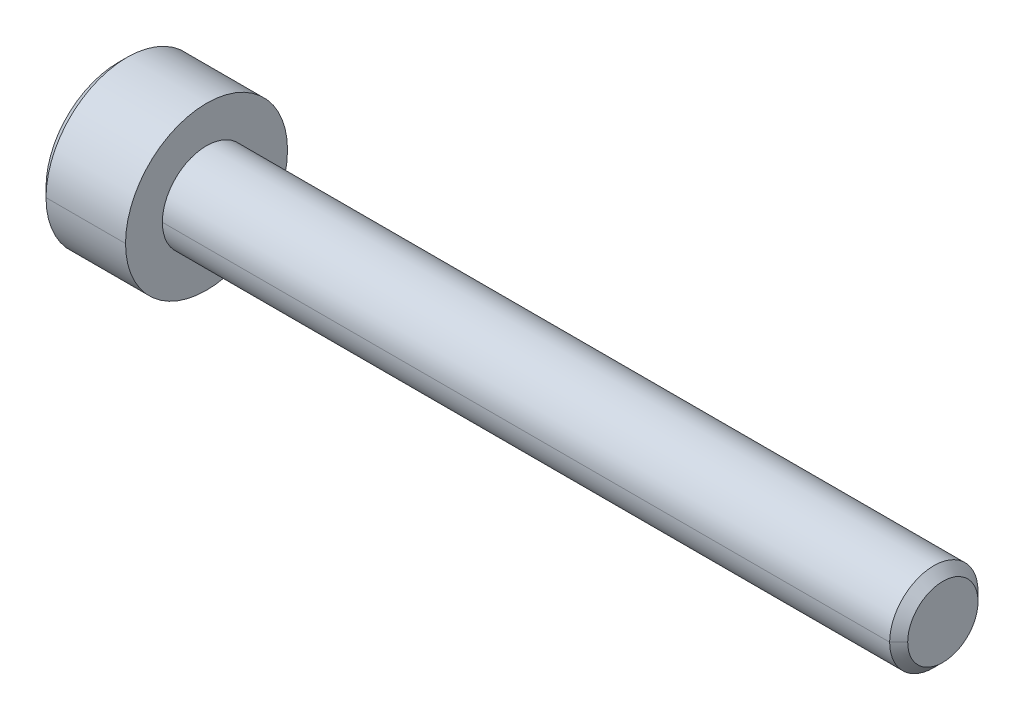
ISO-10303-21;
HEADER;
FILE_DESCRIPTION(('STEP AP214'),'2;1');
FILE_NAME('part.step','',(''),(''),'','','');
FILE_SCHEMA(('AUTOMOTIVE_DESIGN { 1 0 10303 214 1 1 1 1 }'));
ENDSEC;
DATA;
#1=APPLICATION_CONTEXT('core data for automotive mechanical design processes');
#2=APPLICATION_PROTOCOL_DEFINITION('international standard','automotive_design',2000,#1);
#3=PRODUCT_CONTEXT('',#1,'mechanical');
#4=PRODUCT('Part','Part','',(#3));
#5=PRODUCT_RELATED_PRODUCT_CATEGORY('part','',(#4));
#6=PRODUCT_DEFINITION_FORMATION('','',#4);
#7=PRODUCT_DEFINITION_CONTEXT('part definition',#1,'design');
#8=PRODUCT_DEFINITION('design','',#6,#7);
#9=PRODUCT_DEFINITION_SHAPE('','',#8);
#10=(LENGTH_UNIT() NAMED_UNIT(*) SI_UNIT(.MILLI.,.METRE.));
#11=(NAMED_UNIT(*) PLANE_ANGLE_UNIT() SI_UNIT($,.RADIAN.));
#12=(NAMED_UNIT(*) SI_UNIT($,.STERADIAN.) SOLID_ANGLE_UNIT());
#13=UNCERTAINTY_MEASURE_WITH_UNIT(LENGTH_MEASURE(1.E-05),#10,'distance_accuracy_value','');
#14=(GEOMETRIC_REPRESENTATION_CONTEXT(3) GLOBAL_UNCERTAINTY_ASSIGNED_CONTEXT((#13)) GLOBAL_UNIT_ASSIGNED_CONTEXT((#10,
#11,#12)) REPRESENTATION_CONTEXT('',''));
#15=CARTESIAN_POINT('',(0.,0.,0.));
#16=DIRECTION('',(0.,0.,1.));
#17=DIRECTION('',(1.,0.,0.));
#18=AXIS2_PLACEMENT_3D('',#15,#16,#17);
#19=CARTESIAN_POINT('',(-3.,0.,0.));
#20=DIRECTION('',(1.,0.,0.));
#21=DIRECTION('',(0.,-1.,0.));
#22=AXIS2_PLACEMENT_3D('',#19,#20,#21);
#23=CONICAL_SURFACE('',#22,2.45,0.7853981634);
#24=CARTESIAN_POINT('',(-2.7,0.,0.));
#25=DIRECTION('',(1.,0.,0.));
#26=DIRECTION('',(0.,0.,-1.));
#27=AXIS2_PLACEMENT_3D('',#24,#25,#26);
#28=CIRCLE('',#27,2.75);
#29=CARTESIAN_POINT('',(-2.7,0.,-2.75));
#30=VERTEX_POINT('',#29);
#31=CARTESIAN_POINT('',(-2.70000000000077,0.,2.75000000000077));
#32=VERTEX_POINT('',#31);
#33=EDGE_CURVE('E12',#30,#32,#28,.T.);
#34=ORIENTED_EDGE('',*,*,#33,.F.);
#35=DIRECTION('',(0.707106781184743,0.,-0.707106781188352));
#36=VECTOR('',#35,1.);
#37=CARTESIAN_POINT('',(-3.,0.,-2.45));
#38=LINE('',#37,#36);
#39=CARTESIAN_POINT('',(-3.,0.,-2.45));
#40=VERTEX_POINT('',#39);
#41=EDGE_CURVE('E29',#40,#30,#38,.T.);
#42=ORIENTED_EDGE('',*,*,#41,.F.);
#43=CARTESIAN_POINT('',(-3.,0.,0.));
#44=DIRECTION('',(1.,0.,0.));
#45=DIRECTION('',(0.,0.,-1.));
#46=AXIS2_PLACEMENT_3D('',#43,#44,#45);
#47=CIRCLE('',#46,2.45);
#48=CARTESIAN_POINT('',(-3.,0.,2.45));
#49=VERTEX_POINT('',#48);
#50=EDGE_CURVE('E199',#40,#49,#47,.T.);
#51=ORIENTED_EDGE('',*,*,#50,.T.);
#52=DIRECTION('',(0.707106781184743,0.,0.707106781188352));
#53=VECTOR('',#52,1.);
#54=CARTESIAN_POINT('',(-3.,0.,2.45));
#55=LINE('',#54,#53);
#56=EDGE_CURVE('E196',#49,#32,#55,.T.);
#57=ORIENTED_EDGE('',*,*,#56,.T.);
#58=EDGE_LOOP('',(#34,#42,#51,#57));
#59=FACE_BOUND('',#58,.T.);
#60=ADVANCED_FACE('F20',(#59),#23,.T.);
#61=CARTESIAN_POINT('',(-3.,0.,0.));
#62=DIRECTION('',(1.,0.,0.));
#63=DIRECTION('',(0.,1.,0.));
#64=AXIS2_PLACEMENT_3D('',#61,#62,#63);
#65=CONICAL_SURFACE('',#64,2.45,0.7853981634);
#66=CARTESIAN_POINT('',(-3.,0.,0.));
#67=DIRECTION('',(1.,0.,0.));
#68=DIRECTION('',(0.,0.,-1.));
#69=AXIS2_PLACEMENT_3D('',#66,#67,#68);
#70=CIRCLE('',#69,2.45);
#71=EDGE_CURVE('E195',#49,#40,#70,.T.);
#72=ORIENTED_EDGE('',*,*,#71,.T.);
#73=ORIENTED_EDGE('',*,*,#41,.T.);
#74=CARTESIAN_POINT('',(-2.7,0.,0.));
#75=DIRECTION('',(1.,0.,0.));
#76=DIRECTION('',(0.,0.,-1.));
#77=AXIS2_PLACEMENT_3D('',#74,#75,#76);
#78=CIRCLE('',#77,2.75);
#79=EDGE_CURVE('E455',#32,#30,#78,.T.);
#80=ORIENTED_EDGE('',*,*,#79,.F.);
#81=ORIENTED_EDGE('',*,*,#56,.F.);
#82=EDGE_LOOP('',(#72,#73,#80,#81));
#83=FACE_BOUND('',#82,.T.);
#84=ADVANCED_FACE('F470',(#83),#65,.T.);
#85=CARTESIAN_POINT('',(25.,0.,0.));
#86=DIRECTION('',(-1.,0.,0.));
#87=DIRECTION('',(0.,1.,0.));
#88=AXIS2_PLACEMENT_3D('',#85,#86,#87);
#89=CYLINDRICAL_SURFACE('',#88,2.75);
#90=ORIENTED_EDGE('',*,*,#79,.T.);
#91=DIRECTION('',(-1.,0.,0.));
#92=VECTOR('',#91,1.);
#93=CARTESIAN_POINT('',(0.,0.,-2.75));
#94=LINE('',#93,#92);
#95=CARTESIAN_POINT('',(0.,0.,-2.75));
#96=VERTEX_POINT('',#95);
#97=EDGE_CURVE('E449',#96,#30,#94,.T.);
#98=ORIENTED_EDGE('',*,*,#97,.F.);
#99=CARTESIAN_POINT('',(0.,0.,0.));
#100=DIRECTION('',(1.,0.,0.));
#101=DIRECTION('',(0.,0.,-1.));
#102=AXIS2_PLACEMENT_3D('',#99,#100,#101);
#103=CIRCLE('',#102,2.75);
#104=CARTESIAN_POINT('',(0.,0.,2.75));
#105=VERTEX_POINT('',#104);
#106=EDGE_CURVE('E442',#105,#96,#103,.T.);
#107=ORIENTED_EDGE('',*,*,#106,.F.);
#108=DIRECTION('',(-1.,0.,0.));
#109=VECTOR('',#108,1.);
#110=CARTESIAN_POINT('',(0.,0.,2.75));
#111=LINE('',#110,#109);
#112=EDGE_CURVE('E436',#105,#32,#111,.T.);
#113=ORIENTED_EDGE('',*,*,#112,.T.);
#114=EDGE_LOOP('',(#90,#98,#107,#113));
#115=FACE_BOUND('',#114,.T.);
#116=ADVANCED_FACE('F473',(#115),#89,.T.);
#117=CARTESIAN_POINT('',(25.,0.,0.));
#118=DIRECTION('',(-1.,0.,0.));
#119=DIRECTION('',(0.,-1.,0.));
#120=AXIS2_PLACEMENT_3D('',#117,#118,#119);
#121=CYLINDRICAL_SURFACE('',#120,2.75);
#122=CARTESIAN_POINT('',(0.,0.,0.));
#123=DIRECTION('',(1.,0.,0.));
#124=DIRECTION('',(0.,0.,-1.));
#125=AXIS2_PLACEMENT_3D('',#122,#123,#124);
#126=CIRCLE('',#125,2.75);
#127=EDGE_CURVE('E431',#96,#105,#126,.T.);
#128=ORIENTED_EDGE('',*,*,#127,.F.);
#129=ORIENTED_EDGE('',*,*,#97,.T.);
#130=ORIENTED_EDGE('',*,*,#33,.T.);
#131=ORIENTED_EDGE('',*,*,#112,.F.);
#132=EDGE_LOOP('',(#128,#129,#130,#131));
#133=FACE_BOUND('',#132,.T.);
#134=ADVANCED_FACE('F476',(#133),#121,.T.);
#135=CARTESIAN_POINT('',(0.,2.75,0.));
#136=DIRECTION('',(-1.,0.,0.));
#137=DIRECTION('',(0.,0.,1.));
#138=AXIS2_PLACEMENT_3D('',#135,#136,#137);
#139=PLANE('',#138);
#140=CARTESIAN_POINT('',(0.,0.,0.));
#141=DIRECTION('',(1.,0.,0.));
#142=DIRECTION('',(0.,0.,-1.));
#143=AXIS2_PLACEMENT_3D('',#140,#141,#142);
#144=CIRCLE('',#143,1.5);
#145=CARTESIAN_POINT('',(0.,0.,-1.5));
#146=VERTEX_POINT('',#145);
#147=CARTESIAN_POINT('',(0.,0.,1.5));
#148=VERTEX_POINT('',#147);
#149=EDGE_CURVE('E430',#146,#148,#144,.T.);
#150=ORIENTED_EDGE('',*,*,#149,.F.);
#151=CARTESIAN_POINT('',(0.,0.,0.));
#152=DIRECTION('',(1.,0.,0.));
#153=DIRECTION('',(0.,0.,-1.));
#154=AXIS2_PLACEMENT_3D('',#151,#152,#153);
#155=CIRCLE('',#154,1.5);
#156=EDGE_CURVE('E419',#148,#146,#155,.T.);
#157=ORIENTED_EDGE('',*,*,#156,.F.);
#158=EDGE_LOOP('',(#150,#157));
#159=FACE_BOUND('',#158,.T.);
#160=ORIENTED_EDGE('',*,*,#127,.T.);
#161=ORIENTED_EDGE('',*,*,#106,.T.);
#162=EDGE_LOOP('',(#160,#161));
#163=FACE_BOUND('',#162,.T.);
#164=ADVANCED_FACE('F478',(#159,#163),#139,.F.);
#165=CARTESIAN_POINT('',(25.,0.,0.));
#166=DIRECTION('',(-1.,0.,0.));
#167=DIRECTION('',(0.,1.,0.));
#168=AXIS2_PLACEMENT_3D('',#165,#166,#167);
#169=CYLINDRICAL_SURFACE('',#168,1.5);
#170=ORIENTED_EDGE('',*,*,#156,.T.);
#171=DIRECTION('',(-1.,0.,0.));
#172=VECTOR('',#171,1.);
#173=CARTESIAN_POINT('',(24.6935,0.,-1.5));
#174=LINE('',#173,#172);
#175=CARTESIAN_POINT('',(24.6935,0.,-1.5));
#176=VERTEX_POINT('',#175);
#177=EDGE_CURVE('E414',#176,#146,#174,.T.);
#178=ORIENTED_EDGE('',*,*,#177,.F.);
#179=CARTESIAN_POINT('',(24.6935,0.,0.));
#180=DIRECTION('',(1.,0.,0.));
#181=DIRECTION('',(0.,0.,-1.));
#182=AXIS2_PLACEMENT_3D('',#179,#180,#181);
#183=CIRCLE('',#182,1.5);
#184=CARTESIAN_POINT('',(24.6935,0.,1.5));
#185=VERTEX_POINT('',#184);
#186=EDGE_CURVE('E413',#185,#176,#183,.T.);
#187=ORIENTED_EDGE('',*,*,#186,.F.);
#188=DIRECTION('',(-1.,0.,0.));
#189=VECTOR('',#188,1.);
#190=CARTESIAN_POINT('',(24.6935,0.,1.5));
#191=LINE('',#190,#189);
#192=EDGE_CURVE('E399',#185,#148,#191,.T.);
#193=ORIENTED_EDGE('',*,*,#192,.T.);
#194=EDGE_LOOP('',(#170,#178,#187,#193));
#195=FACE_BOUND('',#194,.T.);
#196=ADVANCED_FACE('F480',(#195),#169,.T.);
#197=CARTESIAN_POINT('',(25.,0.,0.));
#198=DIRECTION('',(-1.,0.,0.));
#199=DIRECTION('',(0.,-1.,0.));
#200=AXIS2_PLACEMENT_3D('',#197,#198,#199);
#201=CYLINDRICAL_SURFACE('',#200,1.5);
#202=CARTESIAN_POINT('',(24.6935,0.,0.));
#203=DIRECTION('',(1.,0.,0.));
#204=DIRECTION('',(0.,0.,-1.));
#205=AXIS2_PLACEMENT_3D('',#202,#203,#204);
#206=CIRCLE('',#205,1.5);
#207=EDGE_CURVE('E392',#176,#185,#206,.T.);
#208=ORIENTED_EDGE('',*,*,#207,.F.);
#209=ORIENTED_EDGE('',*,*,#177,.T.);
#210=ORIENTED_EDGE('',*,*,#149,.T.);
#211=ORIENTED_EDGE('',*,*,#192,.F.);
#212=EDGE_LOOP('',(#208,#209,#210,#211));
#213=FACE_BOUND('',#212,.T.);
#214=ADVANCED_FACE('F488',(#213),#201,.T.);
#215=CARTESIAN_POINT('',(24.6935,0.,0.));
#216=DIRECTION('',(-1.,0.,0.));
#217=DIRECTION('',(0.,-1.,0.));
#218=AXIS2_PLACEMENT_3D('',#215,#216,#217);
#219=CONICAL_SURFACE('',#218,1.5,0.7853981634);
#220=CARTESIAN_POINT('',(25.,0.,0.));
#221=DIRECTION('',(1.,0.,0.));
#222=DIRECTION('',(0.,0.,-1.));
#223=AXIS2_PLACEMENT_3D('',#220,#221,#222);
#224=CIRCLE('',#223,1.1935);
#225=CARTESIAN_POINT('',(25.,0.,-1.1935));
#226=VERTEX_POINT('',#225);
#227=CARTESIAN_POINT('',(24.9999999999992,0.,1.19349999999922));
#228=VERTEX_POINT('',#227);
#229=EDGE_CURVE('E386',#226,#228,#224,.T.);
#230=ORIENTED_EDGE('',*,*,#229,.F.);
#231=DIRECTION('',(-0.707106781184743,0.,-0.707106781188352));
#232=VECTOR('',#231,1.);
#233=CARTESIAN_POINT('',(24.9999999999992,0.,-1.19349999999922));
#234=LINE('',#233,#232);
#235=EDGE_CURVE('E382',#226,#176,#234,.T.);
#236=ORIENTED_EDGE('',*,*,#235,.T.);
#237=ORIENTED_EDGE('',*,*,#207,.T.);
#238=DIRECTION('',(-0.707106781184743,0.,0.707106781188352));
#239=VECTOR('',#238,1.);
#240=CARTESIAN_POINT('',(24.9999999999992,0.,1.19349999999922));
#241=LINE('',#240,#239);
#242=EDGE_CURVE('E360',#228,#185,#241,.T.);
#243=ORIENTED_EDGE('',*,*,#242,.F.);
#244=EDGE_LOOP('',(#230,#236,#237,#243));
#245=FACE_BOUND('',#244,.T.);
#246=ADVANCED_FACE('F525',(#245),#219,.T.);
#247=CARTESIAN_POINT('',(24.6935,0.,0.));
#248=DIRECTION('',(-1.,0.,0.));
#249=DIRECTION('',(0.,1.,0.));
#250=AXIS2_PLACEMENT_3D('',#247,#248,#249);
#251=CONICAL_SURFACE('',#250,1.5,0.7853981634);
#252=ORIENTED_EDGE('',*,*,#186,.T.);
#253=ORIENTED_EDGE('',*,*,#235,.F.);
#254=CARTESIAN_POINT('',(25.,0.,0.));
#255=DIRECTION('',(1.,0.,0.));
#256=DIRECTION('',(0.,0.,-1.));
#257=AXIS2_PLACEMENT_3D('',#254,#255,#256);
#258=CIRCLE('',#257,1.1935);
#259=EDGE_CURVE('E354',#228,#226,#258,.T.);
#260=ORIENTED_EDGE('',*,*,#259,.F.);
#261=ORIENTED_EDGE('',*,*,#242,.T.);
#262=EDGE_LOOP('',(#252,#253,#260,#261));
#263=FACE_BOUND('',#262,.T.);
#264=ADVANCED_FACE('F534',(#263),#251,.T.);
#265=CARTESIAN_POINT('',(25.,1.1935,0.));
#266=DIRECTION('',(-1.,0.,0.));
#267=DIRECTION('',(0.,0.,1.));
#268=AXIS2_PLACEMENT_3D('',#265,#266,#267);
#269=PLANE('',#268);
#270=ORIENTED_EDGE('',*,*,#229,.T.);
#271=ORIENTED_EDGE('',*,*,#259,.T.);
#272=EDGE_LOOP('',(#270,#271));
#273=FACE_BOUND('',#272,.T.);
#274=ADVANCED_FACE('F543',(#273),#269,.F.);
#275=CARTESIAN_POINT('',(-3.,0.,0.));
#276=DIRECTION('',(1.,0.,0.));
#277=DIRECTION('',(0.,0.,-1.));
#278=AXIS2_PLACEMENT_3D('',#275,#276,#277);
#279=PLANE('',#278);
#280=ORIENTED_EDGE('',*,*,#50,.F.);
#281=ORIENTED_EDGE('',*,*,#71,.F.);
#282=EDGE_LOOP('',(#280,#281));
#283=FACE_BOUND('',#282,.T.);
#284=DIRECTION('',(0.,0.50000000000002,-0.866025403784427));
#285=VECTOR('',#284,1.);
#286=CARTESIAN_POINT('',(-3.,-1.4433756729741,0.));
#287=LINE('',#286,#285);
#288=CARTESIAN_POINT('',(-3.,-1.4433756729741,0.));
#289=VERTEX_POINT('',#288);
#290=CARTESIAN_POINT('',(-3.,-0.72168783648703,-1.25));
#291=VERTEX_POINT('',#290);
#292=EDGE_CURVE('E343',#289,#291,#287,.T.);
#293=ORIENTED_EDGE('',*,*,#292,.T.);
#294=DIRECTION('',(0.,1.,0.));
#295=VECTOR('',#294,1.);
#296=CARTESIAN_POINT('',(-3.,-0.72168783648703,-1.25));
#297=LINE('',#296,#295);
#298=CARTESIAN_POINT('',(-3.,0.72168783648703,-1.25));
#299=VERTEX_POINT('',#298);
#300=EDGE_CURVE('E355',#291,#299,#297,.T.);
#301=ORIENTED_EDGE('',*,*,#300,.T.);
#302=DIRECTION('',(0.,0.50000000000002,0.866025403784427));
#303=VECTOR('',#302,1.);
#304=CARTESIAN_POINT('',(-3.,0.72168783648703,-1.25));
#305=LINE('',#304,#303);
#306=CARTESIAN_POINT('',(-3.,1.4433756729741,0.));
#307=VERTEX_POINT('',#306);
#308=EDGE_CURVE('E362',#299,#307,#305,.T.);
#309=ORIENTED_EDGE('',*,*,#308,.T.);
#310=DIRECTION('',(0.,-0.50000000000002,0.866025403784427));
#311=VECTOR('',#310,1.);
#312=CARTESIAN_POINT('',(-3.,1.4433756729741,0.));
#313=LINE('',#312,#311);
#314=CARTESIAN_POINT('',(-3.,0.72168783648703,1.25));
#315=VERTEX_POINT('',#314);
#316=EDGE_CURVE('E227',#307,#315,#313,.T.);
#317=ORIENTED_EDGE('',*,*,#316,.T.);
#318=DIRECTION('',(0.,-1.,0.));
#319=VECTOR('',#318,1.);
#320=CARTESIAN_POINT('',(-3.,0.72168783648703,1.25));
#321=LINE('',#320,#319);
#322=CARTESIAN_POINT('',(-3.,-0.72168783648703,1.25));
#323=VERTEX_POINT('',#322);
#324=EDGE_CURVE('E223',#315,#323,#321,.T.);
#325=ORIENTED_EDGE('',*,*,#324,.T.);
#326=DIRECTION('',(0.,-0.50000000000002,-0.866025403784427));
#327=VECTOR('',#326,1.);
#328=CARTESIAN_POINT('',(-3.,-0.72168783648703,1.25));
#329=LINE('',#328,#327);
#330=EDGE_CURVE('E221',#323,#289,#329,.T.);
#331=ORIENTED_EDGE('',*,*,#330,.T.);
#332=EDGE_LOOP('',(#293,#301,#309,#317,#325,#331));
#333=FACE_BOUND('',#332,.T.);
#334=ADVANCED_FACE('F341',(#283,#333),#279,.F.);
#335=CARTESIAN_POINT('',(-1.5,-0.72168783648703,1.25));
#336=DIRECTION('',(0.,0.866025403784427,-0.50000000000002));
#337=DIRECTION('',(0.,0.50000000000002,0.866025403784427));
#338=AXIS2_PLACEMENT_3D('',#335,#336,#337);
#339=PLANE('',#338);
#340=ORIENTED_EDGE('',*,*,#330,.F.);
#341=DIRECTION('',(-1.,0.,0.));
#342=VECTOR('',#341,1.);
#343=CARTESIAN_POINT('',(-1.5,-0.72168783648703,1.25));
#344=LINE('',#343,#342);
#345=CARTESIAN_POINT('',(-1.5,-0.72168783648703,1.25));
#346=VERTEX_POINT('',#345);
#347=EDGE_CURVE('E330',#346,#323,#344,.T.);
#348=ORIENTED_EDGE('',*,*,#347,.F.);
#349=DIRECTION('',(0.,-0.50000000000002,-0.866025403784427));
#350=VECTOR('',#349,1.);
#351=CARTESIAN_POINT('',(-1.5,-0.72168783648703,1.25));
#352=LINE('',#351,#350);
#353=CARTESIAN_POINT('',(-1.5,-1.08253175473055,0.625000000000032));
#354=VERTEX_POINT('',#353);
#355=EDGE_CURVE('E325',#346,#354,#352,.T.);
#356=ORIENTED_EDGE('',*,*,#355,.T.);
#357=DIRECTION('',(0.,-0.50000000000002,-0.866025403784427));
#358=VECTOR('',#357,1.);
#359=CARTESIAN_POINT('',(-1.5,-0.72168783648703,1.25));
#360=LINE('',#359,#358);
#361=CARTESIAN_POINT('',(-1.5,-1.4433756729741,0.));
#362=VERTEX_POINT('',#361);
#363=EDGE_CURVE('E320',#354,#362,#360,.T.);
#364=ORIENTED_EDGE('',*,*,#363,.T.);
#365=DIRECTION('',(-1.,0.,0.));
#366=VECTOR('',#365,1.);
#367=CARTESIAN_POINT('',(-1.5,-1.4433756729741,0.));
#368=LINE('',#367,#366);
#369=EDGE_CURVE('E314',#362,#289,#368,.T.);
#370=ORIENTED_EDGE('',*,*,#369,.T.);
#371=EDGE_LOOP('',(#340,#348,#356,#364,#370));
#372=FACE_BOUND('',#371,.T.);
#373=ADVANCED_FACE('F346',(#372),#339,.T.);
#374=CARTESIAN_POINT('',(-1.5,-1.4433756729741,0.));
#375=DIRECTION('',(0.,0.866025403784427,0.50000000000002));
#376=DIRECTION('',(0.,-0.50000000000002,0.866025403784427));
#377=AXIS2_PLACEMENT_3D('',#374,#375,#376);
#378=PLANE('',#377);
#379=ORIENTED_EDGE('',*,*,#292,.F.);
#380=ORIENTED_EDGE('',*,*,#369,.F.);
#381=DIRECTION('',(0.,0.50000000000002,-0.866025403784427));
#382=VECTOR('',#381,1.);
#383=CARTESIAN_POINT('',(-1.5,-1.4433756729741,0.));
#384=LINE('',#383,#382);
#385=CARTESIAN_POINT('',(-1.5,-1.08253175473053,-0.625000000000024));
#386=VERTEX_POINT('',#385);
#387=EDGE_CURVE('E309',#362,#386,#384,.T.);
#388=ORIENTED_EDGE('',*,*,#387,.T.);
#389=DIRECTION('',(0.,0.50000000000002,-0.866025403784427));
#390=VECTOR('',#389,1.);
#391=CARTESIAN_POINT('',(-1.5,-1.4433756729741,0.));
#392=LINE('',#391,#390);
#393=CARTESIAN_POINT('',(-1.5,-0.72168783648703,-1.25));
#394=VERTEX_POINT('',#393);
#395=EDGE_CURVE('E304',#386,#394,#392,.T.);
#396=ORIENTED_EDGE('',*,*,#395,.T.);
#397=DIRECTION('',(-1.,0.,0.));
#398=VECTOR('',#397,1.);
#399=CARTESIAN_POINT('',(-1.5,-0.72168783648703,-1.25));
#400=LINE('',#399,#398);
#401=EDGE_CURVE('E298',#394,#291,#400,.T.);
#402=ORIENTED_EDGE('',*,*,#401,.T.);
#403=EDGE_LOOP('',(#379,#380,#388,#396,#402));
#404=FACE_BOUND('',#403,.T.);
#405=ADVANCED_FACE('F350',(#404),#378,.T.);
#406=CARTESIAN_POINT('',(-1.5,-0.72168783648703,-1.25));
#407=DIRECTION('',(0.,0.,1.));
#408=DIRECTION('',(1.,0.,0.));
#409=AXIS2_PLACEMENT_3D('',#406,#407,#408);
#410=PLANE('',#409);
#411=ORIENTED_EDGE('',*,*,#300,.F.);
#412=ORIENTED_EDGE('',*,*,#401,.F.);
#413=DIRECTION('',(0.,1.,0.));
#414=VECTOR('',#413,1.);
#415=CARTESIAN_POINT('',(-1.5,-0.72168783648703,-1.25));
#416=LINE('',#415,#414);
#417=CARTESIAN_POINT('',(-1.5,0.,-1.25));
#418=VERTEX_POINT('',#417);
#419=EDGE_CURVE('E293',#394,#418,#416,.T.);
#420=ORIENTED_EDGE('',*,*,#419,.T.);
#421=DIRECTION('',(0.,1.,0.));
#422=VECTOR('',#421,1.);
#423=CARTESIAN_POINT('',(-1.5,-0.72168783648703,-1.25));
#424=LINE('',#423,#422);
#425=CARTESIAN_POINT('',(-1.5,0.72168783648703,-1.25));
#426=VERTEX_POINT('',#425);
#427=EDGE_CURVE('E288',#418,#426,#424,.T.);
#428=ORIENTED_EDGE('',*,*,#427,.T.);
#429=DIRECTION('',(-1.,0.,0.));
#430=VECTOR('',#429,1.);
#431=CARTESIAN_POINT('',(-1.5,0.72168783648703,-1.25));
#432=LINE('',#431,#430);
#433=EDGE_CURVE('E282',#426,#299,#432,.T.);
#434=ORIENTED_EDGE('',*,*,#433,.T.);
#435=EDGE_LOOP('',(#411,#412,#420,#428,#434));
#436=FACE_BOUND('',#435,.T.);
#437=ADVANCED_FACE('F574',(#436),#410,.T.);
#438=CARTESIAN_POINT('',(-1.5,0.72168783648703,-1.25));
#439=DIRECTION('',(0.,-0.866025403784427,0.50000000000002));
#440=DIRECTION('',(0.,-0.50000000000002,-0.866025403784427));
#441=AXIS2_PLACEMENT_3D('',#438,#439,#440);
#442=PLANE('',#441);
#443=ORIENTED_EDGE('',*,*,#308,.F.);
#444=ORIENTED_EDGE('',*,*,#433,.F.);
#445=DIRECTION('',(0.,0.50000000000002,0.866025403784427));
#446=VECTOR('',#445,1.);
#447=CARTESIAN_POINT('',(-1.5,0.72168783648703,-1.25));
#448=LINE('',#447,#446);
#449=CARTESIAN_POINT('',(-1.5,1.08253175473055,-0.625000000000032));
#450=VERTEX_POINT('',#449);
#451=EDGE_CURVE('E276',#426,#450,#448,.T.);
#452=ORIENTED_EDGE('',*,*,#451,.T.);
#453=DIRECTION('',(0.,0.50000000000002,0.866025403784427));
#454=VECTOR('',#453,1.);
#455=CARTESIAN_POINT('',(-1.5,0.72168783648703,-1.25));
#456=LINE('',#455,#454);
#457=CARTESIAN_POINT('',(-1.5,1.4433756729741,0.));
#458=VERTEX_POINT('',#457);
#459=EDGE_CURVE('E271',#450,#458,#456,.T.);
#460=ORIENTED_EDGE('',*,*,#459,.T.);
#461=DIRECTION('',(-1.,0.,0.));
#462=VECTOR('',#461,1.);
#463=CARTESIAN_POINT('',(-1.5,1.4433756729741,0.));
#464=LINE('',#463,#462);
#465=EDGE_CURVE('E265',#458,#307,#464,.T.);
#466=ORIENTED_EDGE('',*,*,#465,.T.);
#467=EDGE_LOOP('',(#443,#444,#452,#460,#466));
#468=FACE_BOUND('',#467,.T.);
#469=ADVANCED_FACE('F582',(#468),#442,.T.);
#470=CARTESIAN_POINT('',(-1.5,1.4433756729741,0.));
#471=DIRECTION('',(0.,-0.866025403784427,-0.50000000000002));
#472=DIRECTION('',(0.,0.50000000000002,-0.866025403784427));
#473=AXIS2_PLACEMENT_3D('',#470,#471,#472);
#474=PLANE('',#473);
#475=ORIENTED_EDGE('',*,*,#316,.F.);
#476=ORIENTED_EDGE('',*,*,#465,.F.);
#477=DIRECTION('',(0.,-0.50000000000002,0.866025403784427));
#478=VECTOR('',#477,1.);
#479=CARTESIAN_POINT('',(-1.5,1.4433756729741,0.));
#480=LINE('',#479,#478);
#481=CARTESIAN_POINT('',(-1.5,1.08253175473055,0.625000000000032));
#482=VERTEX_POINT('',#481);
#483=EDGE_CURVE('E260',#458,#482,#480,.T.);
#484=ORIENTED_EDGE('',*,*,#483,.T.);
#485=DIRECTION('',(0.,-0.50000000000002,0.866025403784427));
#486=VECTOR('',#485,1.);
#487=CARTESIAN_POINT('',(-1.5,1.4433756729741,0.));
#488=LINE('',#487,#486);
#489=CARTESIAN_POINT('',(-1.5,0.72168783648703,1.25));
#490=VERTEX_POINT('',#489);
#491=EDGE_CURVE('E255',#482,#490,#488,.T.);
#492=ORIENTED_EDGE('',*,*,#491,.T.);
#493=DIRECTION('',(-1.,0.,0.));
#494=VECTOR('',#493,1.);
#495=CARTESIAN_POINT('',(-1.5,0.72168783648703,1.25));
#496=LINE('',#495,#494);
#497=EDGE_CURVE('E249',#490,#315,#496,.T.);
#498=ORIENTED_EDGE('',*,*,#497,.T.);
#499=EDGE_LOOP('',(#475,#476,#484,#492,#498));
#500=FACE_BOUND('',#499,.T.);
#501=ADVANCED_FACE('F591',(#500),#474,.T.);
#502=CARTESIAN_POINT('',(-1.5,0.72168783648703,1.25));
#503=DIRECTION('',(0.,0.,-1.));
#504=DIRECTION('',(-1.,0.,0.));
#505=AXIS2_PLACEMENT_3D('',#502,#503,#504);
#506=PLANE('',#505);
#507=ORIENTED_EDGE('',*,*,#324,.F.);
#508=ORIENTED_EDGE('',*,*,#497,.F.);
#509=DIRECTION('',(0.,-1.,0.));
#510=VECTOR('',#509,1.);
#511=CARTESIAN_POINT('',(-1.5,0.72168783648703,1.25));
#512=LINE('',#511,#510);
#513=CARTESIAN_POINT('',(-1.5,0.,1.25));
#514=VERTEX_POINT('',#513);
#515=EDGE_CURVE('E244',#490,#514,#512,.T.);
#516=ORIENTED_EDGE('',*,*,#515,.T.);
#517=DIRECTION('',(0.,-1.,0.));
#518=VECTOR('',#517,1.);
#519=CARTESIAN_POINT('',(-1.5,0.72168783648703,1.25));
#520=LINE('',#519,#518);
#521=EDGE_CURVE('E154',#514,#346,#520,.T.);
#522=ORIENTED_EDGE('',*,*,#521,.T.);
#523=ORIENTED_EDGE('',*,*,#347,.T.);
#524=EDGE_LOOP('',(#507,#508,#516,#522,#523));
#525=FACE_BOUND('',#524,.T.);
#526=ADVANCED_FACE('F600',(#525),#506,.T.);
#527=CARTESIAN_POINT('',(-1.5,0.,0.));
#528=DIRECTION('',(1.,0.,0.));
#529=DIRECTION('',(0.,0.,-1.));
#530=AXIS2_PLACEMENT_3D('',#527,#528,#529);
#531=PLANE('',#530);
#532=CARTESIAN_POINT('',(-1.5,0.,0.));
#533=DIRECTION('',(1.,0.,0.));
#534=DIRECTION('',(0.,0.,-1.));
#535=AXIS2_PLACEMENT_3D('',#532,#533,#534);
#536=CIRCLE('',#535,1.25);
#537=EDGE_CURVE('E135',#514,#354,#536,.T.);
#538=ORIENTED_EDGE('',*,*,#537,.T.);
#539=ORIENTED_EDGE('',*,*,#355,.F.);
#540=ORIENTED_EDGE('',*,*,#521,.F.);
#541=EDGE_LOOP('',(#538,#539,#540));
#542=FACE_BOUND('',#541,.T.);
#543=ADVANCED_FACE('F609',(#542),#531,.F.);
#544=CARTESIAN_POINT('',(-1.5,0.,0.));
#545=DIRECTION('',(-1.,0.,0.));
#546=DIRECTION('',(0.,1.,0.));
#547=AXIS2_PLACEMENT_3D('',#544,#545,#546);
#548=CONICAL_SURFACE('',#547,1.25,1.308996939);
#549=DIRECTION('',(-0.258819045098413,0.,-0.965925826290169));
#550=VECTOR('',#549,1.);
#551=CARTESIAN_POINT('',(-1.16506350946679,0.,0.));
#552=LINE('',#551,#550);
#553=CARTESIAN_POINT('',(-1.1650635094611,0.,0.));
#554=VERTEX_POINT('',#553);
#555=EDGE_CURVE('E131',#554,#418,#552,.T.);
#556=ORIENTED_EDGE('',*,*,#555,.T.);
#557=CARTESIAN_POINT('',(-1.5,0.,0.));
#558=DIRECTION('',(1.,0.,0.));
#559=DIRECTION('',(0.,0.,-1.));
#560=AXIS2_PLACEMENT_3D('',#557,#558,#559);
#561=CIRCLE('',#560,1.25);
#562=EDGE_CURVE('E149',#386,#418,#561,.T.);
#563=ORIENTED_EDGE('',*,*,#562,.F.);
#564=CARTESIAN_POINT('',(-1.5,0.,0.));
#565=DIRECTION('',(1.,0.,0.));
#566=DIRECTION('',(0.,0.,-1.));
#567=AXIS2_PLACEMENT_3D('',#564,#565,#566);
#568=CIRCLE('',#567,1.25);
#569=EDGE_CURVE('E140',#354,#386,#568,.T.);
#570=ORIENTED_EDGE('',*,*,#569,.F.);
#571=ORIENTED_EDGE('',*,*,#537,.F.);
#572=DIRECTION('',(-0.258819045098413,0.,0.965925826290169));
#573=VECTOR('',#572,1.);
#574=CARTESIAN_POINT('',(-1.16506350946679,0.,0.));
#575=LINE('',#574,#573);
#576=EDGE_CURVE('E127',#554,#514,#575,.T.);
#577=ORIENTED_EDGE('',*,*,#576,.F.);
#578=EDGE_LOOP('',(#556,#563,#570,#571,#577));
#579=FACE_BOUND('',#578,.T.);
#580=ADVANCED_FACE('F129',(#579),#548,.F.);
#581=CARTESIAN_POINT('',(-1.5,0.,0.));
#582=DIRECTION('',(-1.,0.,0.));
#583=DIRECTION('',(0.,-1.,0.));
#584=AXIS2_PLACEMENT_3D('',#581,#582,#583);
#585=CONICAL_SURFACE('',#584,1.25,1.308996939);
#586=ORIENTED_EDGE('',*,*,#576,.T.);
#587=CARTESIAN_POINT('',(-1.5,0.,0.));
#588=DIRECTION('',(1.,0.,0.));
#589=DIRECTION('',(0.,0.,-1.));
#590=AXIS2_PLACEMENT_3D('',#587,#588,#589);
#591=CIRCLE('',#590,1.25);
#592=EDGE_CURVE('E141',#482,#514,#591,.T.);
#593=ORIENTED_EDGE('',*,*,#592,.F.);
#594=CARTESIAN_POINT('',(-1.5,0.,0.));
#595=DIRECTION('',(1.,0.,0.));
#596=DIRECTION('',(0.,0.,-1.));
#597=AXIS2_PLACEMENT_3D('',#594,#595,#596);
#598=CIRCLE('',#597,1.25);
#599=EDGE_CURVE('E814',#450,#482,#598,.T.);
#600=ORIENTED_EDGE('',*,*,#599,.F.);
#601=CARTESIAN_POINT('',(-1.5,0.,0.));
#602=DIRECTION('',(1.,0.,0.));
#603=DIRECTION('',(0.,0.,-1.));
#604=AXIS2_PLACEMENT_3D('',#601,#602,#603);
#605=CIRCLE('',#604,1.25);
#606=EDGE_CURVE('E146',#418,#450,#605,.T.);
#607=ORIENTED_EDGE('',*,*,#606,.F.);
#608=ORIENTED_EDGE('',*,*,#555,.F.);
#609=EDGE_LOOP('',(#586,#593,#600,#607,#608));
#610=FACE_BOUND('',#609,.T.);
#611=ADVANCED_FACE('F143',(#610),#585,.F.);
#612=CARTESIAN_POINT('',(-1.5,0.,0.));
#613=DIRECTION('',(1.,0.,0.));
#614=DIRECTION('',(0.,0.,-1.));
#615=AXIS2_PLACEMENT_3D('',#612,#613,#614);
#616=PLANE('',#615);
#617=ORIENTED_EDGE('',*,*,#606,.T.);
#618=ORIENTED_EDGE('',*,*,#451,.F.);
#619=ORIENTED_EDGE('',*,*,#427,.F.);
#620=EDGE_LOOP('',(#617,#618,#619));
#621=FACE_BOUND('',#620,.T.);
#622=ADVANCED_FACE('F632',(#621),#616,.F.);
#623=CARTESIAN_POINT('',(-1.5,0.,0.));
#624=DIRECTION('',(1.,0.,0.));
#625=DIRECTION('',(0.,0.,-1.));
#626=AXIS2_PLACEMENT_3D('',#623,#624,#625);
#627=PLANE('',#626);
#628=ORIENTED_EDGE('',*,*,#459,.F.);
#629=ORIENTED_EDGE('',*,*,#599,.T.);
#630=ORIENTED_EDGE('',*,*,#483,.F.);
#631=EDGE_LOOP('',(#628,#629,#630));
#632=FACE_BOUND('',#631,.T.);
#633=ADVANCED_FACE('F640',(#632),#627,.F.);
#634=CARTESIAN_POINT('',(-1.5,0.,0.));
#635=DIRECTION('',(1.,0.,0.));
#636=DIRECTION('',(0.,0.,-1.));
#637=AXIS2_PLACEMENT_3D('',#634,#635,#636);
#638=PLANE('',#637);
#639=ORIENTED_EDGE('',*,*,#592,.T.);
#640=ORIENTED_EDGE('',*,*,#515,.F.);
#641=ORIENTED_EDGE('',*,*,#491,.F.);
#642=EDGE_LOOP('',(#639,#640,#641));
#643=FACE_BOUND('',#642,.T.);
#644=ADVANCED_FACE('F649',(#643),#638,.F.);
#645=CARTESIAN_POINT('',(-1.5,0.,0.));
#646=DIRECTION('',(1.,0.,0.));
#647=DIRECTION('',(0.,0.,-1.));
#648=AXIS2_PLACEMENT_3D('',#645,#646,#647);
#649=PLANE('',#648);
#650=ORIENTED_EDGE('',*,*,#569,.T.);
#651=ORIENTED_EDGE('',*,*,#387,.F.);
#652=ORIENTED_EDGE('',*,*,#363,.F.);
#653=EDGE_LOOP('',(#650,#651,#652));
#654=FACE_BOUND('',#653,.T.);
#655=ADVANCED_FACE('F658',(#654),#649,.F.);
#656=CARTESIAN_POINT('',(-1.5,0.,0.));
#657=DIRECTION('',(1.,0.,0.));
#658=DIRECTION('',(0.,0.,-1.));
#659=AXIS2_PLACEMENT_3D('',#656,#657,#658);
#660=PLANE('',#659);
#661=ORIENTED_EDGE('',*,*,#562,.T.);
#662=ORIENTED_EDGE('',*,*,#419,.F.);
#663=ORIENTED_EDGE('',*,*,#395,.F.);
#664=EDGE_LOOP('',(#661,#662,#663));
#665=FACE_BOUND('',#664,.T.);
#666=ADVANCED_FACE('F667',(#665),#660,.F.);
#667=CLOSED_SHELL('',(#60,#84,#116,#134,#164,#196,#214,#246,#264,#274,#334,#373,#405,#437,#469,
#501,#526,#543,#580,#611,#622,#633,#644,#655,#666));
#668=MANIFOLD_SOLID_BREP('B1',#667);
#669=ADVANCED_BREP_SHAPE_REPRESENTATION('',(#18,#668),#14);
#670=SHAPE_DEFINITION_REPRESENTATION(#9,#669);
ENDSEC;
END-ISO-10303-21;
